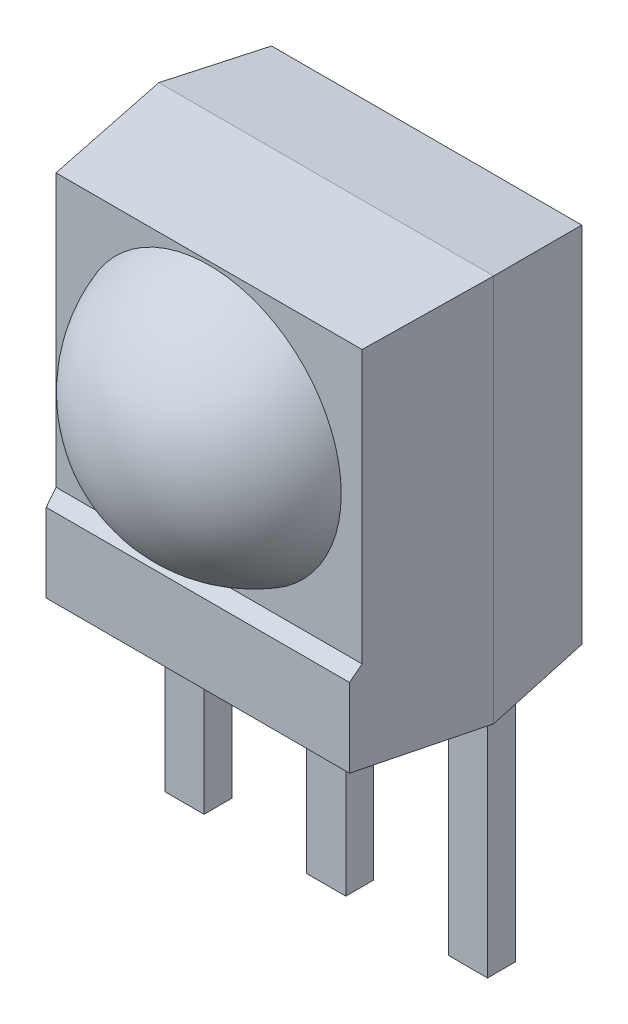
ISO-10303-21;
HEADER;
FILE_DESCRIPTION(('STEP AP214'),'2;1');
FILE_NAME('part.step','',(''),(''),'','','');
FILE_SCHEMA(('AUTOMOTIVE_DESIGN { 1 0 10303 214 1 1 1 1 }'));
ENDSEC;
DATA;
#1=APPLICATION_CONTEXT('core data for automotive mechanical design processes');
#2=APPLICATION_PROTOCOL_DEFINITION('international standard','automotive_design',2000,#1);
#3=PRODUCT_CONTEXT('',#1,'mechanical');
#4=PRODUCT('Part','Part','',(#3));
#5=PRODUCT_RELATED_PRODUCT_CATEGORY('part','',(#4));
#6=PRODUCT_DEFINITION_FORMATION('','',#4);
#7=PRODUCT_DEFINITION_CONTEXT('part definition',#1,'design');
#8=PRODUCT_DEFINITION('design','',#6,#7);
#9=PRODUCT_DEFINITION_SHAPE('','',#8);
#10=(LENGTH_UNIT() NAMED_UNIT(*) SI_UNIT(.MILLI.,.METRE.));
#11=(NAMED_UNIT(*) PLANE_ANGLE_UNIT() SI_UNIT($,.RADIAN.));
#12=(NAMED_UNIT(*) SI_UNIT($,.STERADIAN.) SOLID_ANGLE_UNIT());
#13=UNCERTAINTY_MEASURE_WITH_UNIT(LENGTH_MEASURE(1.E-05),#10,'distance_accuracy_value','');
#14=(GEOMETRIC_REPRESENTATION_CONTEXT(3) GLOBAL_UNCERTAINTY_ASSIGNED_CONTEXT((#13)) GLOBAL_UNIT_ASSIGNED_CONTEXT((#10,
#11,#12)) REPRESENTATION_CONTEXT('',''));
#15=CARTESIAN_POINT('',(0.,0.,0.));
#16=DIRECTION('',(0.,0.,1.));
#17=DIRECTION('',(1.,0.,0.));
#18=AXIS2_PLACEMENT_3D('',#15,#16,#17);
#19=CARTESIAN_POINT('',(3.,6.95,0.));
#20=DIRECTION('',(0.,-0.994507445692902,-0.10466585145777));
#21=DIRECTION('',(0.,0.10466585145777,-0.994507445692902));
#22=AXIS2_PLACEMENT_3D('',#19,#20,#21);
#23=PLANE('',#22);
#24=DIRECTION('',(-0.121209830498051,-0.103894140426895,0.987174850052203));
#25=VECTOR('',#24,1.);
#26=CARTESIAN_POINT('',(3.,6.95,0.));
#27=LINE('',#26,#25);
#28=CARTESIAN_POINT('',(3.,6.95,0.));
#29=VERTEX_POINT('',#28);
#30=CARTESIAN_POINT('',(2.7421524221039,6.72898779037478,2.1));
#31=VERTEX_POINT('',#30);
#32=EDGE_CURVE('E362',#29,#31,#27,.T.);
#33=ORIENTED_EDGE('',*,*,#32,.F.);
#34=DIRECTION('',(-1.,0.,0.));
#35=VECTOR('',#34,1.);
#36=CARTESIAN_POINT('',(3.,6.95,0.));
#37=LINE('',#36,#35);
#38=CARTESIAN_POINT('',(-3.,6.95,0.));
#39=VERTEX_POINT('',#38);
#40=EDGE_CURVE('E323',#29,#39,#37,.T.);
#41=ORIENTED_EDGE('',*,*,#40,.T.);
#42=DIRECTION('',(0.121209830498051,-0.103894140426895,0.987174850052204));
#43=VECTOR('',#42,1.);
#44=CARTESIAN_POINT('',(-2.9118490619438,6.87444205309469,0.717931777480599));
#45=LINE('',#44,#43);
#46=CARTESIAN_POINT('',(-2.7421524221039,6.72898779037478,2.1));
#47=VERTEX_POINT('',#46);
#48=EDGE_CURVE('E314',#39,#47,#45,.T.);
#49=ORIENTED_EDGE('',*,*,#48,.T.);
#50=DIRECTION('',(-1.,0.,0.));
#51=VECTOR('',#50,1.);
#52=CARTESIAN_POINT('',(3.,6.72898779037478,2.1));
#53=LINE('',#52,#51);
#54=EDGE_CURVE('E11',#31,#47,#53,.T.);
#55=ORIENTED_EDGE('',*,*,#54,.F.);
#56=EDGE_LOOP('',(#33,#41,#49,#55));
#57=FACE_BOUND('',#56,.T.);
#58=ADVANCED_FACE('F33',(#57),#23,.F.);
#59=CARTESIAN_POINT('',(3.,6.72898779037478,2.1));
#60=DIRECTION('',(0.,0.,-1.));
#61=DIRECTION('',(0.,1.,0.));
#62=AXIS2_PLACEMENT_3D('',#59,#60,#61);
#63=PLANE('',#62);
#64=CARTESIAN_POINT('',(0.,4.3,2.1));
#65=DIRECTION('',(0.,0.,-1.));
#66=DIRECTION('',(-1.,0.,0.));
#67=AXIS2_PLACEMENT_3D('',#64,#65,#66);
#68=CIRCLE('',#67,2.3685438564654);
#69=CARTESIAN_POINT('',(-2.3685438564654,4.3,2.1));
#70=VERTEX_POINT('',#69);
#71=EDGE_CURVE('E305',#70,#70,#68,.T.);
#72=ORIENTED_EDGE('',*,*,#71,.T.);
#73=EDGE_LOOP('',(#72));
#74=FACE_BOUND('',#73,.T.);
#75=DIRECTION('',(0.,-1.,0.));
#76=VECTOR('',#75,1.);
#77=CARTESIAN_POINT('',(2.7421524221039,6.72898779037478,2.1));
#78=LINE('',#77,#76);
#79=CARTESIAN_POINT('',(2.7421524221039,1.85,2.1));
#80=VERTEX_POINT('',#79);
#81=EDGE_CURVE('E368',#31,#80,#78,.T.);
#82=ORIENTED_EDGE('',*,*,#81,.F.);
#83=ORIENTED_EDGE('',*,*,#54,.T.);
#84=DIRECTION('',(0.,-1.,0.));
#85=VECTOR('',#84,1.);
#86=CARTESIAN_POINT('',(-2.7421524221039,6.72898779037478,2.1));
#87=LINE('',#86,#85);
#88=CARTESIAN_POINT('',(-2.7421524221039,1.85,2.1));
#89=VERTEX_POINT('',#88);
#90=EDGE_CURVE('E311',#47,#89,#87,.T.);
#91=ORIENTED_EDGE('',*,*,#90,.T.);
#92=DIRECTION('',(-1.,0.,0.));
#93=VECTOR('',#92,1.);
#94=CARTESIAN_POINT('',(3.,1.85,2.1));
#95=LINE('',#94,#93);
#96=EDGE_CURVE('E42',#80,#89,#95,.T.);
#97=ORIENTED_EDGE('',*,*,#96,.F.);
#98=EDGE_LOOP('',(#82,#83,#91,#97));
#99=FACE_BOUND('',#98,.T.);
#100=ADVANCED_FACE('F352',(#74,#99),#63,.F.);
#101=CARTESIAN_POINT('',(3.,1.85,2.1));
#102=DIRECTION('',(0.,-0.707106781186549,-0.707106781186546));
#103=DIRECTION('',(0.,0.707106781186546,-0.707106781186549));
#104=AXIS2_PLACEMENT_3D('',#101,#102,#103);
#105=PLANE('',#104);
#106=DIRECTION('',(-0.0864964017104584,-0.704456660303222,0.704456660303225));
#107=VECTOR('',#106,1.);
#108=CARTESIAN_POINT('',(2.74408154163578,1.8657114177686,2.0842885822314));
#109=LINE('',#108,#107);
#110=CARTESIAN_POINT('',(2.71759550992332,1.65,2.3));
#111=VERTEX_POINT('',#110);
#112=EDGE_CURVE('E390',#80,#111,#109,.T.);
#113=ORIENTED_EDGE('',*,*,#112,.F.);
#114=ORIENTED_EDGE('',*,*,#96,.T.);
#115=DIRECTION('',(0.0864964017104584,-0.704456660303222,0.704456660303225));
#116=VECTOR('',#115,1.);
#117=CARTESIAN_POINT('',(-2.69919177658264,1.50011362010543,2.44988637989457));
#118=LINE('',#117,#116);
#119=CARTESIAN_POINT('',(-2.71759550992332,1.65,2.3));
#120=VERTEX_POINT('',#119);
#121=EDGE_CURVE('E298',#89,#120,#118,.T.);
#122=ORIENTED_EDGE('',*,*,#121,.T.);
#123=DIRECTION('',(-1.,0.,0.));
#124=VECTOR('',#123,1.);
#125=CARTESIAN_POINT('',(3.,1.65,2.3));
#126=LINE('',#125,#124);
#127=EDGE_CURVE('E275',#111,#120,#126,.T.);
#128=ORIENTED_EDGE('',*,*,#127,.F.);
#129=EDGE_LOOP('',(#113,#114,#122,#128));
#130=FACE_BOUND('',#129,.T.);
#131=ADVANCED_FACE('F357',(#130),#105,.F.);
#132=CARTESIAN_POINT('',(3.,1.65,2.3));
#133=DIRECTION('',(0.,0.,-1.));
#134=DIRECTION('',(-1.,0.,0.));
#135=AXIS2_PLACEMENT_3D('',#132,#133,#134);
#136=PLANE('',#135);
#137=DIRECTION('',(0.,-1.,0.));
#138=VECTOR('',#137,1.);
#139=CARTESIAN_POINT('',(2.71759550992332,22.1308126962814,2.3));
#140=LINE('',#139,#138);
#141=CARTESIAN_POINT('',(2.71759550992332,0.242060991494284,2.3));
#142=VERTEX_POINT('',#141);
#143=EDGE_CURVE('E380',#111,#142,#140,.T.);
#144=ORIENTED_EDGE('',*,*,#143,.F.);
#145=ORIENTED_EDGE('',*,*,#127,.T.);
#146=DIRECTION('',(0.,-1.,0.));
#147=VECTOR('',#146,1.);
#148=CARTESIAN_POINT('',(-2.71759550992332,20.9805736724551,2.3));
#149=LINE('',#148,#147);
#150=CARTESIAN_POINT('',(-2.71759550992332,0.242060991494285,2.3));
#151=VERTEX_POINT('',#150);
#152=EDGE_CURVE('E295',#120,#151,#149,.T.);
#153=ORIENTED_EDGE('',*,*,#152,.T.);
#154=DIRECTION('',(-1.,0.,0.));
#155=VECTOR('',#154,1.);
#156=CARTESIAN_POINT('',(3.,0.242060991494284,2.3));
#157=LINE('',#156,#155);
#158=EDGE_CURVE('E265',#142,#151,#157,.T.);
#159=ORIENTED_EDGE('',*,*,#158,.F.);
#160=EDGE_LOOP('',(#144,#145,#153,#159));
#161=FACE_BOUND('',#160,.T.);
#162=ADVANCED_FACE('F301',(#161),#136,.F.);
#163=CARTESIAN_POINT('',(3.,0.,0.));
#164=DIRECTION('',(0.,0.994507445692902,-0.10466585145777));
#165=DIRECTION('',(0.,0.10466585145777,0.994507445692902));
#166=AXIS2_PLACEMENT_3D('',#163,#164,#165);
#167=PLANE('',#166);
#168=DIRECTION('',(0.121209830498051,-0.103894140426895,-0.987174850052203));
#169=VECTOR('',#168,1.);
#170=CARTESIAN_POINT('',(3.,0.,0.));
#171=LINE('',#170,#169);
#172=CARTESIAN_POINT('',(3.,0.,0.));
#173=VERTEX_POINT('',#172);
#174=EDGE_CURVE('E288',#142,#173,#171,.T.);
#175=ORIENTED_EDGE('',*,*,#174,.F.);
#176=ORIENTED_EDGE('',*,*,#158,.T.);
#177=DIRECTION('',(-0.121209830498051,-0.103894140426895,-0.987174850052204));
#178=VECTOR('',#177,1.);
#179=CARTESIAN_POINT('',(-2.9118490619438,0.0755579469053077,0.717931777480599));
#180=LINE('',#179,#178);
#181=CARTESIAN_POINT('',(-3.,0.,0.));
#182=VERTEX_POINT('',#181);
#183=EDGE_CURVE('E285',#151,#182,#180,.T.);
#184=ORIENTED_EDGE('',*,*,#183,.T.);
#185=DIRECTION('',(-1.,0.,0.));
#186=VECTOR('',#185,1.);
#187=CARTESIAN_POINT('',(3.,0.,0.));
#188=LINE('',#187,#186);
#189=CARTESIAN_POINT('',(-2.89,0.,0.));
#190=VERTEX_POINT('',#189);
#191=EDGE_CURVE('E36',#190,#182,#188,.T.);
#192=ORIENTED_EDGE('',*,*,#191,.F.);
#193=DIRECTION('',(1.,0.,0.));
#194=VECTOR('',#193,1.);
#195=CARTESIAN_POINT('',(-2.89,0.,0.));
#196=LINE('',#195,#194);
#197=CARTESIAN_POINT('',(-2.19,0.,0.));
#198=VERTEX_POINT('',#197);
#199=EDGE_CURVE('E178',#190,#198,#196,.T.);
#200=ORIENTED_EDGE('',*,*,#199,.T.);
#201=CARTESIAN_POINT('',(-0.35,0.,0.));
#202=VERTEX_POINT('',#201);
#203=EDGE_CURVE('E259',#202,#198,#188,.T.);
#204=ORIENTED_EDGE('',*,*,#203,.F.);
#205=DIRECTION('',(1.,0.,0.));
#206=VECTOR('',#205,1.);
#207=CARTESIAN_POINT('',(-0.35,0.,0.));
#208=LINE('',#207,#206);
#209=CARTESIAN_POINT('',(0.35,0.,0.));
#210=VERTEX_POINT('',#209);
#211=EDGE_CURVE('E246',#202,#210,#208,.T.);
#212=ORIENTED_EDGE('',*,*,#211,.T.);
#213=CARTESIAN_POINT('',(2.19,0.,0.));
#214=VERTEX_POINT('',#213);
#215=EDGE_CURVE('E257',#214,#210,#188,.T.);
#216=ORIENTED_EDGE('',*,*,#215,.F.);
#217=DIRECTION('',(1.,0.,0.));
#218=VECTOR('',#217,1.);
#219=CARTESIAN_POINT('',(2.19,0.,0.));
#220=LINE('',#219,#218);
#221=CARTESIAN_POINT('',(2.89,0.,0.));
#222=VERTEX_POINT('',#221);
#223=EDGE_CURVE('E213',#214,#222,#220,.T.);
#224=ORIENTED_EDGE('',*,*,#223,.T.);
#225=EDGE_CURVE('E258',#173,#222,#188,.T.);
#226=ORIENTED_EDGE('',*,*,#225,.F.);
#227=EDGE_LOOP('',(#175,#176,#184,#192,#200,#204,#212,#216,#224,#226));
#228=FACE_BOUND('',#227,.T.);
#229=ADVANCED_FACE('F284',(#228),#167,.F.);
#230=CARTESIAN_POINT('',(3.,0.,0.));
#231=DIRECTION('',(0.,0.992546151641323,0.121869343405141));
#232=DIRECTION('',(0.,-0.121869343405141,0.992546151641323));
#233=AXIS2_PLACEMENT_3D('',#230,#231,#232);
#234=PLANE('',#233);
#235=DIRECTION('',(-1.,0.,0.));
#236=VECTOR('',#235,1.);
#237=CARTESIAN_POINT('',(-2.88999999999049,0.0613922804291178,-0.5));
#238=LINE('',#237,#236);
#239=CARTESIAN_POINT('',(-2.19,0.0613922804514489,-0.5));
#240=VERTEX_POINT('',#239);
#241=CARTESIAN_POINT('',(-2.89,0.0613922804514489,-0.5));
#242=VERTEX_POINT('',#241);
#243=EDGE_CURVE('E50',#240,#242,#238,.T.);
#244=ORIENTED_EDGE('',*,*,#243,.T.);
#245=DIRECTION('',(0.,-0.121869343405141,0.992546151641323));
#246=VECTOR('',#245,1.);
#247=CARTESIAN_POINT('',(-2.89,7426.12891147394,-60480.9664738453));
#248=LINE('',#247,#246);
#249=EDGE_CURVE('E198',#242,#190,#248,.T.);
#250=ORIENTED_EDGE('',*,*,#249,.T.);
#251=ORIENTED_EDGE('',*,*,#191,.T.);
#252=DIRECTION('',(0.120974291151348,0.120974291151348,-0.985256536015295));
#253=VECTOR('',#252,1.);
#254=CARTESIAN_POINT('',(-2.91219132528257,0.0878086747174268,-0.715144266280098));
#255=LINE('',#254,#253);
#256=CARTESIAN_POINT('',(-2.77898779037478,0.221012209625216,-1.8));
#257=VERTEX_POINT('',#256);
#258=EDGE_CURVE('E320',#182,#257,#255,.T.);
#259=ORIENTED_EDGE('',*,*,#258,.T.);
#260=DIRECTION('',(-1.,0.,0.));
#261=VECTOR('',#260,1.);
#262=CARTESIAN_POINT('',(3.,0.221012209625216,-1.8));
#263=LINE('',#262,#261);
#264=CARTESIAN_POINT('',(2.77898779037478,0.221012209625216,-1.8));
#265=VERTEX_POINT('',#264);
#266=EDGE_CURVE('E263',#265,#257,#263,.T.);
#267=ORIENTED_EDGE('',*,*,#266,.F.);
#268=DIRECTION('',(-0.120974291151348,0.120974291151348,-0.985256536015295));
#269=VECTOR('',#268,1.);
#270=CARTESIAN_POINT('',(3.,0.,0.));
#271=LINE('',#270,#269);
#272=EDGE_CURVE('E377',#173,#265,#271,.T.);
#273=ORIENTED_EDGE('',*,*,#272,.F.);
#274=ORIENTED_EDGE('',*,*,#225,.T.);
#275=DIRECTION('',(0.,0.121869343405141,-0.992546151641323));
#276=VECTOR('',#275,1.);
#277=CARTESIAN_POINT('',(2.89,7426.12891147394,-60480.9664738453));
#278=LINE('',#277,#276);
#279=CARTESIAN_POINT('',(2.89,0.0613922804514489,-0.5));
#280=VERTEX_POINT('',#279);
#281=EDGE_CURVE('E214',#222,#280,#278,.T.);
#282=ORIENTED_EDGE('',*,*,#281,.T.);
#283=DIRECTION('',(-1.,0.,0.));
#284=VECTOR('',#283,1.);
#285=CARTESIAN_POINT('',(2.19000000000951,0.0613922804291178,-0.5));
#286=LINE('',#285,#284);
#287=CARTESIAN_POINT('',(2.19,0.0613922804514489,-0.5));
#288=VERTEX_POINT('',#287);
#289=EDGE_CURVE('E206',#280,#288,#286,.T.);
#290=ORIENTED_EDGE('',*,*,#289,.T.);
#291=DIRECTION('',(0.,-0.121869343405141,0.992546151641323));
#292=VECTOR('',#291,1.);
#293=CARTESIAN_POINT('',(2.19,7426.12891147394,-60480.9664738453));
#294=LINE('',#293,#292);
#295=EDGE_CURVE('E210',#288,#214,#294,.T.);
#296=ORIENTED_EDGE('',*,*,#295,.T.);
#297=ORIENTED_EDGE('',*,*,#215,.T.);
#298=DIRECTION('',(0.,0.121869343405141,-0.992546151641323));
#299=VECTOR('',#298,1.);
#300=CARTESIAN_POINT('',(0.349999999993443,7426.12891147394,-60480.9664738453));
#301=LINE('',#300,#299);
#302=CARTESIAN_POINT('',(0.35,0.0613922805428047,-0.5));
#303=VERTEX_POINT('',#302);
#304=EDGE_CURVE('E247',#210,#303,#301,.T.);
#305=ORIENTED_EDGE('',*,*,#304,.T.);
#306=DIRECTION('',(-1.,0.,0.));
#307=VECTOR('',#306,1.);
#308=CARTESIAN_POINT('',(-0.349999999990491,0.0613922804291178,-0.5));
#309=LINE('',#308,#307);
#310=CARTESIAN_POINT('',(-0.35,0.0613922805428047,-0.5));
#311=VERTEX_POINT('',#310);
#312=EDGE_CURVE('E243',#303,#311,#309,.T.);
#313=ORIENTED_EDGE('',*,*,#312,.T.);
#314=DIRECTION('',(0.,-0.121869343405141,0.992546151641323));
#315=VECTOR('',#314,1.);
#316=CARTESIAN_POINT('',(-0.349999999993443,7426.12891147394,-60480.9664738453));
#317=LINE('',#316,#315);
#318=EDGE_CURVE('E234',#311,#202,#317,.T.);
#319=ORIENTED_EDGE('',*,*,#318,.T.);
#320=ORIENTED_EDGE('',*,*,#203,.T.);
#321=DIRECTION('',(0.,0.121869343405141,-0.992546151641323));
#322=VECTOR('',#321,1.);
#323=CARTESIAN_POINT('',(-2.19,7426.12891147394,-60480.9664738453));
#324=LINE('',#323,#322);
#325=EDGE_CURVE('E55',#198,#240,#324,.T.);
#326=ORIENTED_EDGE('',*,*,#325,.T.);
#327=EDGE_LOOP('',(#244,#250,#251,#259,#267,#273,#274,#282,#290,#296,#297,#305,#313,#319,#320,#326));
#328=FACE_BOUND('',#327,.T.);
#329=ADVANCED_FACE('F334',(#328),#234,.F.);
#330=CARTESIAN_POINT('',(3.,6.72898779037479,-1.8));
#331=DIRECTION('',(0.,0.,1.));
#332=DIRECTION('',(0.,-1.,0.));
#333=AXIS2_PLACEMENT_3D('',#330,#331,#332);
#334=PLANE('',#333);
#335=DIRECTION('',(0.,-1.,0.));
#336=VECTOR('',#335,1.);
#337=CARTESIAN_POINT('',(2.77898779037478,22.1308126962814,-1.8));
#338=LINE('',#337,#336);
#339=CARTESIAN_POINT('',(2.77898779037478,6.72898779037479,-1.8));
#340=VERTEX_POINT('',#339);
#341=EDGE_CURVE('E376',#340,#265,#338,.T.);
#342=ORIENTED_EDGE('',*,*,#341,.T.);
#343=ORIENTED_EDGE('',*,*,#266,.T.);
#344=DIRECTION('',(0.,-1.,0.));
#345=VECTOR('',#344,1.);
#346=CARTESIAN_POINT('',(-2.77898779037478,20.9805736724551,-1.8));
#347=LINE('',#346,#345);
#348=CARTESIAN_POINT('',(-2.77898779037478,6.72898779037479,-1.8));
#349=VERTEX_POINT('',#348);
#350=EDGE_CURVE('E299',#349,#257,#347,.T.);
#351=ORIENTED_EDGE('',*,*,#350,.F.);
#352=DIRECTION('',(-1.,0.,0.));
#353=VECTOR('',#352,1.);
#354=CARTESIAN_POINT('',(3.,6.72898779037479,-1.8));
#355=LINE('',#354,#353);
#356=EDGE_CURVE('E325',#340,#349,#355,.T.);
#357=ORIENTED_EDGE('',*,*,#356,.F.);
#358=EDGE_LOOP('',(#342,#343,#351,#357));
#359=FACE_BOUND('',#358,.T.);
#360=ADVANCED_FACE('F415',(#359),#334,.F.);
#361=CARTESIAN_POINT('',(3.,6.95,0.));
#362=DIRECTION('',(0.,-0.992546151641323,0.12186934340514));
#363=DIRECTION('',(0.,-0.12186934340514,-0.992546151641323));
#364=AXIS2_PLACEMENT_3D('',#361,#362,#363);
#365=PLANE('',#364);
#366=DIRECTION('',(0.120974291151348,0.120974291151348,0.985256536015295));
#367=VECTOR('',#366,1.);
#368=CARTESIAN_POINT('',(3.,6.95,0.));
#369=LINE('',#368,#367);
#370=EDGE_CURVE('E367',#340,#29,#369,.T.);
#371=ORIENTED_EDGE('',*,*,#370,.F.);
#372=ORIENTED_EDGE('',*,*,#356,.T.);
#373=DIRECTION('',(-0.120974291151348,0.120974291151348,0.985256536015295));
#374=VECTOR('',#373,1.);
#375=CARTESIAN_POINT('',(-2.91219132528257,6.86219132528257,-0.715144266280098));
#376=LINE('',#375,#374);
#377=EDGE_CURVE('E317',#349,#39,#376,.T.);
#378=ORIENTED_EDGE('',*,*,#377,.T.);
#379=ORIENTED_EDGE('',*,*,#40,.F.);
#380=EDGE_LOOP('',(#371,#372,#378,#379));
#381=FACE_BOUND('',#380,.T.);
#382=ADVANCED_FACE('F411',(#381),#365,.F.);
#383=CARTESIAN_POINT('',(-3.,20.9805736724551,0.));
#384=DIRECTION('',(0.992546151641323,0.,0.121869343405141));
#385=DIRECTION('',(0.121869343405141,0.,-0.992546151641323));
#386=AXIS2_PLACEMENT_3D('',#383,#384,#385);
#387=PLANE('',#386);
#388=ORIENTED_EDGE('',*,*,#258,.F.);
#389=DIRECTION('',(0.,-1.,0.));
#390=VECTOR('',#389,1.);
#391=CARTESIAN_POINT('',(-3.,20.9805736724551,0.));
#392=LINE('',#391,#390);
#393=EDGE_CURVE('E297',#39,#182,#392,.T.);
#394=ORIENTED_EDGE('',*,*,#393,.F.);
#395=ORIENTED_EDGE('',*,*,#377,.F.);
#396=ORIENTED_EDGE('',*,*,#350,.T.);
#397=EDGE_LOOP('',(#388,#394,#395,#396));
#398=FACE_BOUND('',#397,.T.);
#399=ADVANCED_FACE('F405',(#398),#387,.F.);
#400=CARTESIAN_POINT('',(-3.,20.9805736724551,0.));
#401=DIRECTION('',(0.992546151641322,0.,-0.121869343405148));
#402=DIRECTION('',(-0.121869343405148,0.,-0.992546151641322));
#403=AXIS2_PLACEMENT_3D('',#400,#401,#402);
#404=PLANE('',#403);
#405=ORIENTED_EDGE('',*,*,#48,.F.);
#406=ORIENTED_EDGE('',*,*,#393,.T.);
#407=ORIENTED_EDGE('',*,*,#183,.F.);
#408=ORIENTED_EDGE('',*,*,#152,.F.);
#409=ORIENTED_EDGE('',*,*,#121,.F.);
#410=ORIENTED_EDGE('',*,*,#90,.F.);
#411=EDGE_LOOP('',(#405,#406,#407,#408,#409,#410));
#412=FACE_BOUND('',#411,.T.);
#413=ADVANCED_FACE('F293',(#412),#404,.F.);
#414=CARTESIAN_POINT('',(0.,4.3,1.3));
#415=DIRECTION('',(0.,0.,-1.));
#416=DIRECTION('',(-1.,0.,0.));
#417=AXIS2_PLACEMENT_3D('',#414,#415,#416);
#418=SPHERICAL_SURFACE('',#417,2.5);
#419=ORIENTED_EDGE('',*,*,#71,.F.);
#420=EDGE_LOOP('',(#419));
#421=FACE_BOUND('',#420,.T.);
#422=ADVANCED_FACE('F397',(#421),#418,.T.);
#423=CARTESIAN_POINT('',(3.,22.1308126962814,0.));
#424=DIRECTION('',(0.992546151641323,0.,-0.121869343405141));
#425=DIRECTION('',(-0.121869343405141,0.,-0.992546151641323));
#426=AXIS2_PLACEMENT_3D('',#423,#424,#425);
#427=PLANE('',#426);
#428=DIRECTION('',(0.,-1.,0.));
#429=VECTOR('',#428,1.);
#430=CARTESIAN_POINT('',(3.,22.1308126962814,0.));
#431=LINE('',#430,#429);
#432=EDGE_CURVE('E375',#29,#173,#431,.T.);
#433=ORIENTED_EDGE('',*,*,#432,.T.);
#434=ORIENTED_EDGE('',*,*,#272,.T.);
#435=ORIENTED_EDGE('',*,*,#341,.F.);
#436=ORIENTED_EDGE('',*,*,#370,.T.);
#437=EDGE_LOOP('',(#433,#434,#435,#436));
#438=FACE_BOUND('',#437,.T.);
#439=ADVANCED_FACE('F373',(#438),#427,.T.);
#440=CARTESIAN_POINT('',(3.,22.1308126962814,0.));
#441=DIRECTION('',(0.992546151641322,0.,0.121869343405148));
#442=DIRECTION('',(0.121869343405148,0.,-0.992546151641322));
#443=AXIS2_PLACEMENT_3D('',#440,#441,#442);
#444=PLANE('',#443);
#445=ORIENTED_EDGE('',*,*,#432,.F.);
#446=ORIENTED_EDGE('',*,*,#32,.T.);
#447=ORIENTED_EDGE('',*,*,#81,.T.);
#448=ORIENTED_EDGE('',*,*,#112,.T.);
#449=ORIENTED_EDGE('',*,*,#143,.T.);
#450=ORIENTED_EDGE('',*,*,#174,.T.);
#451=EDGE_LOOP('',(#445,#446,#447,#448,#449,#450));
#452=FACE_BOUND('',#451,.T.);
#453=ADVANCED_FACE('F379',(#452),#444,.T.);
#454=CARTESIAN_POINT('',(-0.35,-4.,-0.5));
#455=DIRECTION('',(-1.,0.,0.));
#456=DIRECTION('',(0.,0.,1.));
#457=AXIS2_PLACEMENT_3D('',#454,#455,#456);
#458=PLANE('',#457);
#459=DIRECTION('',(0.,1.,0.));
#460=VECTOR('',#459,1.);
#461=CARTESIAN_POINT('',(-0.35,-4.,0.));
#462=LINE('',#461,#460);
#463=CARTESIAN_POINT('',(-0.35,-4.,0.));
#464=VERTEX_POINT('',#463);
#465=EDGE_CURVE('E645',#464,#202,#462,.T.);
#466=ORIENTED_EDGE('',*,*,#465,.T.);
#467=ORIENTED_EDGE('',*,*,#318,.F.);
#468=DIRECTION('',(0.,1.,0.));
#469=VECTOR('',#468,1.);
#470=CARTESIAN_POINT('',(-0.35,-4.,-0.5));
#471=LINE('',#470,#469);
#472=CARTESIAN_POINT('',(-0.35,-4.,-0.5));
#473=VERTEX_POINT('',#472);
#474=EDGE_CURVE('E381',#473,#311,#471,.T.);
#475=ORIENTED_EDGE('',*,*,#474,.F.);
#476=DIRECTION('',(0.,0.,1.));
#477=VECTOR('',#476,1.);
#478=CARTESIAN_POINT('',(-0.35,-4.,-0.5));
#479=LINE('',#478,#477);
#480=EDGE_CURVE('E250',#473,#464,#479,.T.);
#481=ORIENTED_EDGE('',*,*,#480,.T.);
#482=EDGE_LOOP('',(#466,#467,#475,#481));
#483=FACE_BOUND('',#482,.T.);
#484=ADVANCED_FACE('F470',(#483),#458,.T.);
#485=CARTESIAN_POINT('',(-0.35,-4.,-0.5));
#486=DIRECTION('',(0.,0.,-1.));
#487=DIRECTION('',(-1.,0.,0.));
#488=AXIS2_PLACEMENT_3D('',#485,#486,#487);
#489=PLANE('',#488);
#490=ORIENTED_EDGE('',*,*,#474,.T.);
#491=ORIENTED_EDGE('',*,*,#312,.F.);
#492=DIRECTION('',(0.,1.,0.));
#493=VECTOR('',#492,1.);
#494=CARTESIAN_POINT('',(0.35,-4.,-0.5));
#495=LINE('',#494,#493);
#496=CARTESIAN_POINT('',(0.35,-4.,-0.5));
#497=VERTEX_POINT('',#496);
#498=EDGE_CURVE('E385',#497,#303,#495,.T.);
#499=ORIENTED_EDGE('',*,*,#498,.F.);
#500=DIRECTION('',(-1.,0.,0.));
#501=VECTOR('',#500,1.);
#502=CARTESIAN_POINT('',(-0.35,-4.,-0.5));
#503=LINE('',#502,#501);
#504=EDGE_CURVE('E651',#497,#473,#503,.T.);
#505=ORIENTED_EDGE('',*,*,#504,.T.);
#506=EDGE_LOOP('',(#490,#491,#499,#505));
#507=FACE_BOUND('',#506,.T.);
#508=ADVANCED_FACE('F466',(#507),#489,.T.);
#509=CARTESIAN_POINT('',(0.35,-4.,-0.5));
#510=DIRECTION('',(1.,0.,0.));
#511=DIRECTION('',(0.,0.,-1.));
#512=AXIS2_PLACEMENT_3D('',#509,#510,#511);
#513=PLANE('',#512);
#514=ORIENTED_EDGE('',*,*,#498,.T.);
#515=ORIENTED_EDGE('',*,*,#304,.F.);
#516=DIRECTION('',(0.,1.,0.));
#517=VECTOR('',#516,1.);
#518=CARTESIAN_POINT('',(0.35,-4.,0.));
#519=LINE('',#518,#517);
#520=CARTESIAN_POINT('',(0.35,-4.,0.));
#521=VERTEX_POINT('',#520);
#522=EDGE_CURVE('E650',#521,#210,#519,.T.);
#523=ORIENTED_EDGE('',*,*,#522,.F.);
#524=DIRECTION('',(0.,0.,-1.));
#525=VECTOR('',#524,1.);
#526=CARTESIAN_POINT('',(0.35,-4.,-0.5));
#527=LINE('',#526,#525);
#528=EDGE_CURVE('E670',#521,#497,#527,.T.);
#529=ORIENTED_EDGE('',*,*,#528,.T.);
#530=EDGE_LOOP('',(#514,#515,#523,#529));
#531=FACE_BOUND('',#530,.T.);
#532=ADVANCED_FACE('F469',(#531),#513,.T.);
#533=CARTESIAN_POINT('',(-0.35,-4.,0.));
#534=DIRECTION('',(0.,0.,1.));
#535=DIRECTION('',(1.,0.,0.));
#536=AXIS2_PLACEMENT_3D('',#533,#534,#535);
#537=PLANE('',#536);
#538=ORIENTED_EDGE('',*,*,#211,.F.);
#539=ORIENTED_EDGE('',*,*,#465,.F.);
#540=DIRECTION('',(1.,0.,0.));
#541=VECTOR('',#540,1.);
#542=CARTESIAN_POINT('',(-0.35,-4.,0.));
#543=LINE('',#542,#541);
#544=EDGE_CURVE('E655',#464,#521,#543,.T.);
#545=ORIENTED_EDGE('',*,*,#544,.T.);
#546=ORIENTED_EDGE('',*,*,#522,.T.);
#547=EDGE_LOOP('',(#538,#539,#545,#546));
#548=FACE_BOUND('',#547,.T.);
#549=ADVANCED_FACE('F464',(#548),#537,.T.);
#550=CARTESIAN_POINT('',(-0.35,-4.,0.));
#551=DIRECTION('',(0.,1.,0.));
#552=DIRECTION('',(0.,0.,1.));
#553=AXIS2_PLACEMENT_3D('',#550,#551,#552);
#554=PLANE('',#553);
#555=ORIENTED_EDGE('',*,*,#480,.F.);
#556=ORIENTED_EDGE('',*,*,#504,.F.);
#557=ORIENTED_EDGE('',*,*,#528,.F.);
#558=ORIENTED_EDGE('',*,*,#544,.F.);
#559=EDGE_LOOP('',(#555,#556,#557,#558));
#560=FACE_BOUND('',#559,.T.);
#561=ADVANCED_FACE('F461',(#560),#554,.F.);
#562=CARTESIAN_POINT('',(2.19,-4.,-0.5));
#563=DIRECTION('',(-1.,0.,0.));
#564=DIRECTION('',(0.,0.,1.));
#565=AXIS2_PLACEMENT_3D('',#562,#563,#564);
#566=PLANE('',#565);
#567=DIRECTION('',(0.,1.,0.));
#568=VECTOR('',#567,1.);
#569=CARTESIAN_POINT('',(2.19,-4.,0.));
#570=LINE('',#569,#568);
#571=CARTESIAN_POINT('',(2.19,-4.,0.));
#572=VERTEX_POINT('',#571);
#573=EDGE_CURVE('E229',#572,#214,#570,.T.);
#574=ORIENTED_EDGE('',*,*,#573,.T.);
#575=ORIENTED_EDGE('',*,*,#295,.F.);
#576=DIRECTION('',(0.,1.,0.));
#577=VECTOR('',#576,1.);
#578=CARTESIAN_POINT('',(2.19,-4.,-0.5));
#579=LINE('',#578,#577);
#580=CARTESIAN_POINT('',(2.19,-4.,-0.5));
#581=VERTEX_POINT('',#580);
#582=EDGE_CURVE('E231',#581,#288,#579,.T.);
#583=ORIENTED_EDGE('',*,*,#582,.F.);
#584=DIRECTION('',(0.,0.,1.));
#585=VECTOR('',#584,1.);
#586=CARTESIAN_POINT('',(2.19,-4.,-0.5));
#587=LINE('',#586,#585);
#588=EDGE_CURVE('E217',#581,#572,#587,.T.);
#589=ORIENTED_EDGE('',*,*,#588,.T.);
#590=EDGE_LOOP('',(#574,#575,#583,#589));
#591=FACE_BOUND('',#590,.T.);
#592=ADVANCED_FACE('F445',(#591),#566,.T.);
#593=CARTESIAN_POINT('',(2.19,-4.,-0.5));
#594=DIRECTION('',(0.,0.,-1.));
#595=DIRECTION('',(-1.,0.,0.));
#596=AXIS2_PLACEMENT_3D('',#593,#594,#595);
#597=PLANE('',#596);
#598=ORIENTED_EDGE('',*,*,#582,.T.);
#599=ORIENTED_EDGE('',*,*,#289,.F.);
#600=DIRECTION('',(0.,1.,0.));
#601=VECTOR('',#600,1.);
#602=CARTESIAN_POINT('',(2.89,-4.,-0.5));
#603=LINE('',#602,#601);
#604=CARTESIAN_POINT('',(2.89,-4.,-0.5));
#605=VERTEX_POINT('',#604);
#606=EDGE_CURVE('E235',#605,#280,#603,.T.);
#607=ORIENTED_EDGE('',*,*,#606,.F.);
#608=DIRECTION('',(-1.,0.,0.));
#609=VECTOR('',#608,1.);
#610=CARTESIAN_POINT('',(2.19,-4.,-0.5));
#611=LINE('',#610,#609);
#612=EDGE_CURVE('E226',#605,#581,#611,.T.);
#613=ORIENTED_EDGE('',*,*,#612,.T.);
#614=EDGE_LOOP('',(#598,#599,#607,#613));
#615=FACE_BOUND('',#614,.T.);
#616=ADVANCED_FACE('F441',(#615),#597,.T.);
#617=CARTESIAN_POINT('',(2.89,-4.,-0.5));
#618=DIRECTION('',(1.,0.,0.));
#619=DIRECTION('',(0.,0.,-1.));
#620=AXIS2_PLACEMENT_3D('',#617,#618,#619);
#621=PLANE('',#620);
#622=ORIENTED_EDGE('',*,*,#606,.T.);
#623=ORIENTED_EDGE('',*,*,#281,.F.);
#624=DIRECTION('',(0.,1.,0.));
#625=VECTOR('',#624,1.);
#626=CARTESIAN_POINT('',(2.89,-4.,0.));
#627=LINE('',#626,#625);
#628=CARTESIAN_POINT('',(2.89,-4.,0.));
#629=VERTEX_POINT('',#628);
#630=EDGE_CURVE('E238',#629,#222,#627,.T.);
#631=ORIENTED_EDGE('',*,*,#630,.F.);
#632=DIRECTION('',(0.,0.,-1.));
#633=VECTOR('',#632,1.);
#634=CARTESIAN_POINT('',(2.89,-4.,-0.5));
#635=LINE('',#634,#633);
#636=EDGE_CURVE('E223',#629,#605,#635,.T.);
#637=ORIENTED_EDGE('',*,*,#636,.T.);
#638=EDGE_LOOP('',(#622,#623,#631,#637));
#639=FACE_BOUND('',#638,.T.);
#640=ADVANCED_FACE('F437',(#639),#621,.T.);
#641=CARTESIAN_POINT('',(2.19,-4.,0.));
#642=DIRECTION('',(0.,0.,1.));
#643=DIRECTION('',(1.,0.,0.));
#644=AXIS2_PLACEMENT_3D('',#641,#642,#643);
#645=PLANE('',#644);
#646=ORIENTED_EDGE('',*,*,#223,.F.);
#647=ORIENTED_EDGE('',*,*,#573,.F.);
#648=DIRECTION('',(1.,0.,0.));
#649=VECTOR('',#648,1.);
#650=CARTESIAN_POINT('',(2.19,-4.,0.));
#651=LINE('',#650,#649);
#652=EDGE_CURVE('E220',#572,#629,#651,.T.);
#653=ORIENTED_EDGE('',*,*,#652,.T.);
#654=ORIENTED_EDGE('',*,*,#630,.T.);
#655=EDGE_LOOP('',(#646,#647,#653,#654));
#656=FACE_BOUND('',#655,.T.);
#657=ADVANCED_FACE('F432',(#656),#645,.T.);
#658=CARTESIAN_POINT('',(2.19,-4.,0.));
#659=DIRECTION('',(0.,1.,0.));
#660=DIRECTION('',(0.,0.,1.));
#661=AXIS2_PLACEMENT_3D('',#658,#659,#660);
#662=PLANE('',#661);
#663=ORIENTED_EDGE('',*,*,#588,.F.);
#664=ORIENTED_EDGE('',*,*,#612,.F.);
#665=ORIENTED_EDGE('',*,*,#636,.F.);
#666=ORIENTED_EDGE('',*,*,#652,.F.);
#667=EDGE_LOOP('',(#663,#664,#665,#666));
#668=FACE_BOUND('',#667,.T.);
#669=ADVANCED_FACE('F348',(#668),#662,.F.);
#670=CARTESIAN_POINT('',(-2.89,-4.,-0.5));
#671=DIRECTION('',(-1.,0.,0.));
#672=DIRECTION('',(0.,0.,1.));
#673=AXIS2_PLACEMENT_3D('',#670,#671,#672);
#674=PLANE('',#673);
#675=DIRECTION('',(0.,1.,0.));
#676=VECTOR('',#675,1.);
#677=CARTESIAN_POINT('',(-2.89,-4.,0.));
#678=LINE('',#677,#676);
#679=CARTESIAN_POINT('',(-2.89,-4.,0.));
#680=VERTEX_POINT('',#679);
#681=EDGE_CURVE('E173',#680,#190,#678,.T.);
#682=ORIENTED_EDGE('',*,*,#681,.T.);
#683=ORIENTED_EDGE('',*,*,#249,.F.);
#684=DIRECTION('',(0.,1.,0.));
#685=VECTOR('',#684,1.);
#686=CARTESIAN_POINT('',(-2.89,-4.,-0.5));
#687=LINE('',#686,#685);
#688=CARTESIAN_POINT('',(-2.89,-4.,-0.5));
#689=VERTEX_POINT('',#688);
#690=EDGE_CURVE('E196',#689,#242,#687,.T.);
#691=ORIENTED_EDGE('',*,*,#690,.F.);
#692=DIRECTION('',(0.,0.,1.));
#693=VECTOR('',#692,1.);
#694=CARTESIAN_POINT('',(-2.89,-4.,-0.5));
#695=LINE('',#694,#693);
#696=EDGE_CURVE('E190',#689,#680,#695,.T.);
#697=ORIENTED_EDGE('',*,*,#696,.T.);
#698=EDGE_LOOP('',(#682,#683,#691,#697));
#699=FACE_BOUND('',#698,.T.);
#700=ADVANCED_FACE('F195',(#699),#674,.T.);
#701=CARTESIAN_POINT('',(-2.89,-4.,-0.5));
#702=DIRECTION('',(0.,0.,-1.));
#703=DIRECTION('',(-1.,0.,0.));
#704=AXIS2_PLACEMENT_3D('',#701,#702,#703);
#705=PLANE('',#704);
#706=ORIENTED_EDGE('',*,*,#690,.T.);
#707=ORIENTED_EDGE('',*,*,#243,.F.);
#708=DIRECTION('',(0.,1.,0.));
#709=VECTOR('',#708,1.);
#710=CARTESIAN_POINT('',(-2.19,-4.,-0.5));
#711=LINE('',#710,#709);
#712=CARTESIAN_POINT('',(-2.19,-4.,-0.5));
#713=VERTEX_POINT('',#712);
#714=EDGE_CURVE('E207',#713,#240,#711,.T.);
#715=ORIENTED_EDGE('',*,*,#714,.F.);
#716=DIRECTION('',(-1.,0.,0.));
#717=VECTOR('',#716,1.);
#718=CARTESIAN_POINT('',(-2.89,-4.,-0.5));
#719=LINE('',#718,#717);
#720=EDGE_CURVE('E183',#713,#689,#719,.T.);
#721=ORIENTED_EDGE('',*,*,#720,.T.);
#722=EDGE_LOOP('',(#706,#707,#715,#721));
#723=FACE_BOUND('',#722,.T.);
#724=ADVANCED_FACE('F340',(#723),#705,.T.);
#725=CARTESIAN_POINT('',(-2.19,-4.,-0.5));
#726=DIRECTION('',(1.,0.,0.));
#727=DIRECTION('',(0.,0.,-1.));
#728=AXIS2_PLACEMENT_3D('',#725,#726,#727);
#729=PLANE('',#728);
#730=ORIENTED_EDGE('',*,*,#714,.T.);
#731=ORIENTED_EDGE('',*,*,#325,.F.);
#732=DIRECTION('',(0.,1.,0.));
#733=VECTOR('',#732,1.);
#734=CARTESIAN_POINT('',(-2.19,-4.,0.));
#735=LINE('',#734,#733);
#736=CARTESIAN_POINT('',(-2.19,-4.,0.));
#737=VERTEX_POINT('',#736);
#738=EDGE_CURVE('E182',#737,#198,#735,.T.);
#739=ORIENTED_EDGE('',*,*,#738,.F.);
#740=DIRECTION('',(0.,0.,-1.));
#741=VECTOR('',#740,1.);
#742=CARTESIAN_POINT('',(-2.19,-4.,-0.5));
#743=LINE('',#742,#741);
#744=EDGE_CURVE('E193',#737,#713,#743,.T.);
#745=ORIENTED_EDGE('',*,*,#744,.T.);
#746=EDGE_LOOP('',(#730,#731,#739,#745));
#747=FACE_BOUND('',#746,.T.);
#748=ADVANCED_FACE('F337',(#747),#729,.T.);
#749=CARTESIAN_POINT('',(-2.89,-4.,0.));
#750=DIRECTION('',(0.,0.,1.));
#751=DIRECTION('',(1.,0.,0.));
#752=AXIS2_PLACEMENT_3D('',#749,#750,#751);
#753=PLANE('',#752);
#754=ORIENTED_EDGE('',*,*,#199,.F.);
#755=ORIENTED_EDGE('',*,*,#681,.F.);
#756=DIRECTION('',(1.,0.,0.));
#757=VECTOR('',#756,1.);
#758=CARTESIAN_POINT('',(-2.89,-4.,0.));
#759=LINE('',#758,#757);
#760=EDGE_CURVE('E177',#680,#737,#759,.T.);
#761=ORIENTED_EDGE('',*,*,#760,.T.);
#762=ORIENTED_EDGE('',*,*,#738,.T.);
#763=EDGE_LOOP('',(#754,#755,#761,#762));
#764=FACE_BOUND('',#763,.T.);
#765=ADVANCED_FACE('F175',(#764),#753,.T.);
#766=CARTESIAN_POINT('',(-2.89,-4.,0.));
#767=DIRECTION('',(0.,1.,0.));
#768=DIRECTION('',(0.,0.,1.));
#769=AXIS2_PLACEMENT_3D('',#766,#767,#768);
#770=PLANE('',#769);
#771=ORIENTED_EDGE('',*,*,#696,.F.);
#772=ORIENTED_EDGE('',*,*,#720,.F.);
#773=ORIENTED_EDGE('',*,*,#744,.F.);
#774=ORIENTED_EDGE('',*,*,#760,.F.);
#775=EDGE_LOOP('',(#771,#772,#773,#774));
#776=FACE_BOUND('',#775,.T.);
#777=ADVANCED_FACE('F188',(#776),#770,.F.);
#778=CLOSED_SHELL('',(#58,#100,#131,#162,#229,#329,#360,#382,#399,#413,#422,#439,#453,#484,#508,
#532,#549,#561,#592,#616,#640,#657,#669,#700,#724,#748,#765,#777));
#779=MANIFOLD_SOLID_BREP('B2',#778);
#780=ADVANCED_BREP_SHAPE_REPRESENTATION('',(#18,#779),#14);
#781=SHAPE_DEFINITION_REPRESENTATION(#9,#780);
ENDSEC;
END-ISO-10303-21;
